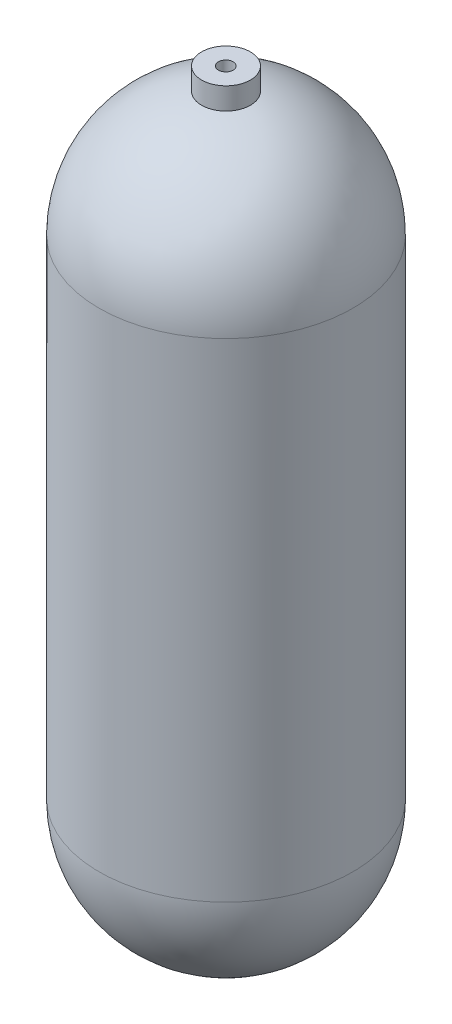
ISO-10303-21;
HEADER;
FILE_DESCRIPTION(('STEP AP214'),'2;1');
FILE_NAME('part.step','',(''),(''),'','','');
FILE_SCHEMA(('AUTOMOTIVE_DESIGN { 1 0 10303 214 1 1 1 1 }'));
ENDSEC;
DATA;
#1=APPLICATION_CONTEXT('core data for automotive mechanical design processes');
#2=APPLICATION_PROTOCOL_DEFINITION('international standard','automotive_design',2000,#1);
#3=PRODUCT_CONTEXT('',#1,'mechanical');
#4=PRODUCT('Part','Part','',(#3));
#5=PRODUCT_RELATED_PRODUCT_CATEGORY('part','',(#4));
#6=PRODUCT_DEFINITION_FORMATION('','',#4);
#7=PRODUCT_DEFINITION_CONTEXT('part definition',#1,'design');
#8=PRODUCT_DEFINITION('design','',#6,#7);
#9=PRODUCT_DEFINITION_SHAPE('','',#8);
#10=(LENGTH_UNIT() NAMED_UNIT(*) SI_UNIT(.MILLI.,.METRE.));
#11=(NAMED_UNIT(*) PLANE_ANGLE_UNIT() SI_UNIT($,.RADIAN.));
#12=(NAMED_UNIT(*) SI_UNIT($,.STERADIAN.) SOLID_ANGLE_UNIT());
#13=UNCERTAINTY_MEASURE_WITH_UNIT(LENGTH_MEASURE(1.E-05),#10,'distance_accuracy_value','');
#14=(GEOMETRIC_REPRESENTATION_CONTEXT(3) GLOBAL_UNCERTAINTY_ASSIGNED_CONTEXT((#13)) GLOBAL_UNIT_ASSIGNED_CONTEXT((#10,
#11,#12)) REPRESENTATION_CONTEXT('',''));
#15=CARTESIAN_POINT('',(0.,0.,0.));
#16=DIRECTION('',(0.,0.,1.));
#17=DIRECTION('',(1.,0.,0.));
#18=AXIS2_PLACEMENT_3D('',#15,#16,#17);
#19=CARTESIAN_POINT('',(0.,400.05,0.));
#20=DIRECTION('',(0.,-1.,0.));
#21=DIRECTION('',(1.,0.,0.));
#22=AXIS2_PLACEMENT_3D('',#19,#20,#21);
#23=SPHERICAL_SURFACE('',#22,79.375);
#24=CARTESIAN_POINT('',(-3.42182891379754,479.283643926154,-3.27282478421702));
#25=CARTESIAN_POINT('',(-3.32724378608084,479.283819493455,-3.36746714349013));
#26=CARTESIAN_POINT('',(-3.22867831230609,479.283993000192,-3.45810923366383));
#27=CARTESIAN_POINT('',(-3.02423425314201,479.284334759627,-3.63080333851585));
#28=CARTESIAN_POINT('',(-2.91835375041532,479.284503010928,-3.71285308677507));
#29=CARTESIAN_POINT('',(-2.6999640744647,479.284833149662,-3.86781322020325));
#30=CARTESIAN_POINT('',(-2.58744907387211,479.284995031285,-3.9407153894491));
#31=CARTESIAN_POINT('',(-2.3566326618785,479.28531118177,-4.07680321265141));
#32=CARTESIAN_POINT('',(-2.23832914921104,479.285465447827,-4.13998530314597));
#33=CARTESIAN_POINT('',(-1.99691881390394,479.285765077557,-4.25610131347749));
#34=CARTESIAN_POINT('',(-1.87381613455248,479.285910448644,-4.3090438479448));
#35=CARTESIAN_POINT('',(-1.62354230722062,479.286191449035,-4.40438854499081));
#36=CARTESIAN_POINT('',(-1.49636967597975,479.286327074728,-4.44678681426872));
#37=CARTESIAN_POINT('',(-1.23898354504171,479.286587479876,-4.52069306280468));
#38=CARTESIAN_POINT('',(-1.10877197182512,479.286712265977,-4.55220775150611));
#39=CARTESIAN_POINT('',(-0.846108785317474,479.286950243412,-4.60416882934251));
#40=CARTESIAN_POINT('',(-0.713656363045905,479.287063430449,-4.62461112928305));
#41=CARTESIAN_POINT('',(-0.447535502216847,479.287277324045,-4.65426034744694));
#42=CARTESIAN_POINT('',(-0.313867395010321,479.287378033902,-4.66347023991067));
#43=CARTESIAN_POINT('',(-0.0461809372042213,479.287566327682,-4.67060040456996));
#44=CARTESIAN_POINT('',(0.0878375244983195,479.287653906745,-4.66851650678845));
#45=CARTESIAN_POINT('',(0.355178188419601,479.287815244416,-4.65306675791729));
#46=CARTESIAN_POINT('',(0.488500605679306,479.287889007572,-4.63970462768494));
#47=CARTESIAN_POINT('',(0.753595086656516,479.288022250376,-4.60179142322715));
#48=CARTESIAN_POINT('',(0.885366559777697,479.288081724741,-4.57723621964258));
#49=CARTESIAN_POINT('',(1.14632161917054,479.288185910946,-4.51712133925673));
#50=CARTESIAN_POINT('',(1.27550619116798,479.288230628514,-4.48156594237651));
#51=CARTESIAN_POINT('',(1.53046679679788,479.288305030239,-4.3996874149897));
#52=CARTESIAN_POINT('',(1.6562415544062,479.28833470884,-4.35336031393506));
#53=CARTESIAN_POINT('',(1.90340160934877,479.288378784059,-4.25028549127625));
#54=CARTESIAN_POINT('',(2.02478851820304,479.288393186344,-4.19354164293117));
#55=CARTESIAN_POINT('',(2.26236886682056,479.288406644321,-4.07003488377526));
#56=CARTESIAN_POINT('',(2.3785603725966,479.288405694346,-4.00326828163797));
#57=CARTESIAN_POINT('',(2.71798349321446,479.288379746245,-3.78864660030895));
#58=CARTESIAN_POINT('',(2.93233192414992,479.288331697435,-3.62635750671579));
#59=CARTESIAN_POINT('',(3.33061873083215,479.288175403232,-3.26817992355853));
#60=CARTESIAN_POINT('',(3.51455716139319,479.288067157947,-3.07229149455881));
#61=CARTESIAN_POINT('',(3.84696905487324,479.28779355619,-2.65239213694546));
#62=CARTESIAN_POINT('',(3.99544250231223,479.287628199693,-2.42838119605677));
#63=CARTESIAN_POINT('',(4.25266528105569,479.287245064216,-1.95861801637802));
#64=CARTESIAN_POINT('',(4.36141457032074,479.287027285181,-1.71286575457981));
#65=CARTESIAN_POINT('',(4.53611370310213,479.286545487143,-1.2065902561513));
#66=CARTESIAN_POINT('',(4.60206353433991,479.286281468127,-0.946067015283424));
#67=CARTESIAN_POINT('',(4.68928839156489,479.285714682821,-0.417646822687992));
#68=CARTESIAN_POINT('',(4.71056343542461,479.285411916548,-0.149749873910391));
#69=CARTESIAN_POINT('',(4.70783571086039,479.284776230514,0.385813755024581));
#70=CARTESIAN_POINT('',(4.68383289579793,479.284443310723,0.653480434944479));
#71=CARTESIAN_POINT('',(4.59123051019416,479.283756766824,1.18098491118413));
#72=CARTESIAN_POINT('',(4.52263093361381,479.283403142712,1.44082270644374));
#73=CARTESIAN_POINT('',(4.34278236071065,479.282685228336,1.94529357918808));
#74=CARTESIAN_POINT('',(4.23153333284552,479.282320938064,2.18992664542767));
#75=CARTESIAN_POINT('',(3.96954388417127,479.281592031846,2.65704342402197));
#76=CARTESIAN_POINT('',(3.81880346503615,479.281227415901,2.87952713731557));
#77=CARTESIAN_POINT('',(3.48211025243716,479.280508209452,3.29602963847848));
#78=CARTESIAN_POINT('',(3.29615744739245,479.280153618951,3.49004841698606));
#79=CARTESIAN_POINT('',(2.89431812922667,479.279464529217,3.84411333339851));
#80=CARTESIAN_POINT('',(2.678431614774,479.279130029984,4.00415946979213));
#81=CARTESIAN_POINT('',(2.22285332712751,479.278490619958,4.28573581768841));
#82=CARTESIAN_POINT('',(1.98316155931369,479.278185709158,4.40726603789565));
#83=CARTESIAN_POINT('',(1.48677685795107,479.277614132023,4.60836062811376));
#84=CARTESIAN_POINT('',(1.23008392668449,479.277347465684,4.68792500375805));
#85=CARTESIAN_POINT('',(0.70698402853909,479.276859949373,4.80282945535449));
#86=CARTESIAN_POINT('',(0.440577070265346,479.276639099361,4.8381695704813));
#87=CARTESIAN_POINT('',(-0.0943892897860293,479.276249485666,4.86362166572035));
#88=CARTESIAN_POINT('',(-0.362948692424168,479.276080722004,4.85373362775032));
#89=CARTESIAN_POINT('',(-0.894593808588021,479.275800071882,4.78901285540226));
#90=CARTESIAN_POINT('',(-1.15767952526183,479.275688185389,4.73418014687415));
#91=CARTESIAN_POINT('',(-1.67091726729561,479.275524472452,4.58111628173989));
#92=CARTESIAN_POINT('',(-1.92106930636321,479.275472645945,4.4828851711302));
#93=CARTESIAN_POINT('',(-2.40130745910758,479.275430500058,4.2458519261364));
#94=CARTESIAN_POINT('',(-2.63139359346798,479.275440180616,4.10704983357286));
#95=CARTESIAN_POINT('',(-3.06508559479799,479.275520866454,3.79266966964993));
#96=CARTESIAN_POINT('',(-3.26869141409355,479.275591871845,3.61709153208195));
#97=CARTESIAN_POINT('',(-3.54967925948017,479.275742654924,3.33018336939835));
#98=CARTESIAN_POINT('',(-3.63931316704184,479.275800337879,3.23056416914393));
#99=CARTESIAN_POINT('',(-3.8098663835227,479.27593006224,3.02414263907862));
#100=CARTESIAN_POINT('',(-3.89078889649241,479.27600209834,2.91734297388361));
#101=CARTESIAN_POINT('',(-4.04337149798114,479.276160053787,2.69727261899747));
#102=CARTESIAN_POINT('',(-4.11502813700409,479.276245978279,2.58399954188612));
#103=CARTESIAN_POINT('',(-4.24851988998129,479.276431047832,2.3518598226456));
#104=CARTESIAN_POINT('',(-4.31035861888711,479.276530188003,2.23299526029405));
#105=CARTESIAN_POINT('',(-4.42382625268296,479.276741049,1.99043331442153));
#106=CARTESIAN_POINT('',(-4.47545118344125,479.276852774696,1.86673407208414));
#107=CARTESIAN_POINT('',(-4.56807766263725,479.277087937657,1.61547194437062));
#108=CARTESIAN_POINT('',(-4.60908312494818,479.277211370584,1.48791050184849));
#109=CARTESIAN_POINT('',(-4.68021574853717,479.27746914736,1.22974447230472));
#110=CARTESIAN_POINT('',(-4.71033931667858,479.277603494796,1.0991388952538));
#111=CARTESIAN_POINT('',(-4.75946595567182,479.277882058667,0.835902738650053));
#112=CARTESIAN_POINT('',(-4.77847312715971,479.278026271441,0.703272924350096));
#113=CARTESIAN_POINT('',(-4.80525272892095,479.278323624378,0.436848301855512));
#114=CARTESIAN_POINT('',(-4.81302217900002,479.278476766897,0.303053194090505));
#115=CARTESIAN_POINT('',(-4.81726080781721,479.278790797548,0.0353335792356443));
#116=CARTESIAN_POINT('',(-4.81373415445964,479.2789516828,-0.0985908619051065));
#117=CARTESIAN_POINT('',(-4.79540906844292,479.279280209578,-0.365749620473259));
#118=CARTESIAN_POINT('',(-4.78060367158939,479.279447855217,-0.498983460287015));
#119=CARTESIAN_POINT('',(-4.73982572902038,479.279788553692,-0.76368068280294));
#120=CARTESIAN_POINT('',(-4.71385730097424,479.279961604512,-0.895144699910887));
#121=CARTESIAN_POINT('',(-4.65091179788235,479.280312090771,-1.15552839773121));
#122=CARTESIAN_POINT('',(-4.61392542138712,479.280489529798,-1.28444583014832));
#123=CARTESIAN_POINT('',(-4.52923141826894,479.280847321085,-1.53865644228725));
#124=CARTESIAN_POINT('',(-4.4815277163297,479.281027672257,-1.66395092982105));
#125=CARTESIAN_POINT('',(-4.37577622558949,479.281389910151,-1.90996580624032));
#126=CARTESIAN_POINT('',(-4.31773769150012,479.281571795362,-2.03069017128688));
#127=CARTESIAN_POINT('',(-4.19172346138077,479.28193590559,-2.2667855992791));
#128=CARTESIAN_POINT('',(-4.12375038326001,479.282118130506,-2.38215806201632));
#129=CARTESIAN_POINT('',(-3.96021646428246,479.28252697025,-2.63474709107922));
#130=CARTESIAN_POINT('',(-3.86199977661827,479.282753346653,-2.77025471270232));
#131=CARTESIAN_POINT('',(-3.65186767280709,479.283202195338,-3.03019615081741));
#132=CARTESIAN_POINT('',(-3.53995225665379,479.283424667619,-3.1546299673043));
#133=CARTESIAN_POINT('',(-3.42182891379754,479.283643926154,-3.27282478421702));
#134=B_SPLINE_CURVE_WITH_KNOTS('',3,(#24,#25,#26,#27,#28,#29,#30,#31,#32,#33,#34,#35,#36,#37,
#38,#39,#40,#41,#42,#43,#44,#45,#46,#47,#48,#49,#50,#51,#52,#53,#54,#55,#56,#57,#58,#59,#60,#61,
#62,#63,#64,#65,#66,#67,#68,#69,#70,#71,#72,#73,#74,#75,#76,#77,#78,#79,#80,#81,#82,#83,#84,#85,
#86,#87,#88,#89,#90,#91,#92,#93,#94,#95,#96,#97,#98,#99,#100,#101,#102,#103,#104,#105,#106,#107,
#108,#109,#110,#111,#112,#113,#114,#115,#116,#117,#118,#119,#120,#121,#122,#123,#124,#125,#126,
#127,#128,#129,#130,#131,#132,#133),.UNSPECIFIED.,.T.,.F.,(4,2,2,2,2,2,2,2,2,2,2,2,2,2,2,2,2,2,
2,2,2,2,2,2,2,2,2,2,2,2,2,2,2,2,2,2,2,2,2,2,2,2,2,2,2,2,2,2,2,2,2,2,2,2,4),(0.,
0.401266521234322,0.8026386201419,1.20436867065518,1.60624564957986,2.00778304088307,
2.40946847403872,2.81090583471243,3.21249135113641,3.61397050822762,4.01559791253047,
4.41709286572405,4.81873605884145,5.22022317797988,5.62185852419278,6.0233448317167,
6.42497936892184,7.22738730117165,8.02979378705878,8.8322006231859,9.63460830848484,
10.4370162239831,11.239423818471,12.0418322394803,12.8442407691474,13.6466498922543,
14.4490589813479,15.2514683343423,16.0538777230316,16.8562869303764,17.6586960300073,
18.4611044188493,19.2635131284953,20.0659213766368,20.8683287743359,21.6707353449165,
22.4731433600969,22.8747776811396,23.276263772727,23.6778989017161,24.079385804085,
24.4810286168597,24.882523190257,25.2841502138552,25.6856289909705,26.0872142189824,
26.4886512918378,26.8903364379005,27.2918735427002,27.6937505939879,28.0954807171208,
28.4968528887321,28.8981194825034,29.3992441728944,29.9003688635166),.UNSPECIFIED.);
#135=CARTESIAN_POINT('',(-3.42182891379754,479.283643926154,-3.27282478421702));
#136=VERTEX_POINT('',#135);
#137=EDGE_CURVE('E39',#136,#136,#134,.T.);
#138=ORIENTED_EDGE('',*,*,#137,.F.);
#139=EDGE_LOOP('',(#138));
#140=FACE_BOUND('',#139,.T.);
#141=CARTESIAN_POINT('',(0.,400.05,0.));
#142=DIRECTION('',(0.,-1.,0.));
#143=DIRECTION('',(0.,0.,-1.));
#144=AXIS2_PLACEMENT_3D('',#141,#142,#143);
#145=CIRCLE('',#144,79.375);
#146=CARTESIAN_POINT('',(0.,400.05,-79.375));
#147=VERTEX_POINT('',#146);
#148=EDGE_CURVE('E47',#147,#147,#145,.T.);
#149=ORIENTED_EDGE('',*,*,#148,.T.);
#150=EDGE_LOOP('',(#149));
#151=FACE_BOUND('',#150,.T.);
#152=ADVANCED_FACE('F35',(#140,#151),#23,.F.);
#153=CARTESIAN_POINT('',(0.,482.6,0.));
#154=DIRECTION('',(0.,-1.,0.));
#155=DIRECTION('',(0.,0.,-1.));
#156=AXIS2_PLACEMENT_3D('',#153,#154,#155);
#157=CYLINDRICAL_SURFACE('',#156,79.375);
#158=CARTESIAN_POINT('',(0.,82.55,0.));
#159=DIRECTION('',(0.,-1.,0.));
#160=DIRECTION('',(0.,0.,-1.));
#161=AXIS2_PLACEMENT_3D('',#158,#159,#160);
#162=CIRCLE('',#161,79.375);
#163=CARTESIAN_POINT('',(0.,82.55,-79.375));
#164=VERTEX_POINT('',#163);
#165=EDGE_CURVE('E53',#164,#164,#162,.T.);
#166=ORIENTED_EDGE('',*,*,#165,.T.);
#167=EDGE_LOOP('',(#166));
#168=FACE_BOUND('',#167,.T.);
#169=ORIENTED_EDGE('',*,*,#148,.F.);
#170=EDGE_LOOP('',(#169));
#171=FACE_BOUND('',#170,.T.);
#172=ADVANCED_FACE('F80',(#168,#171),#157,.F.);
#173=CARTESIAN_POINT('',(0.,82.55,0.));
#174=DIRECTION('',(0.,-1.,0.));
#175=DIRECTION('',(1.,0.,0.));
#176=AXIS2_PLACEMENT_3D('',#173,#174,#175);
#177=SPHERICAL_SURFACE('',#176,79.375);
#178=ORIENTED_EDGE('',*,*,#165,.F.);
#179=EDGE_LOOP('',(#178));
#180=FACE_BOUND('',#179,.T.);
#181=ADVANCED_FACE('F84',(#180),#177,.F.);
#182=CARTESIAN_POINT('',(-0.0532386612324132,495.3,0.0937767604156647));
#183=DIRECTION('',(0.,1.,0.));
#184=DIRECTION('',(0.,0.,1.));
#185=AXIS2_PLACEMENT_3D('',#182,#183,#184);
#186=CYLINDRICAL_SURFACE('',#185,4.76249999999999);
#187=ORIENTED_EDGE('',*,*,#137,.T.);
#188=EDGE_LOOP('',(#187));
#189=FACE_BOUND('',#188,.T.);
#190=CARTESIAN_POINT('',(-0.0532386612324132,495.3,0.0937767604156647));
#191=DIRECTION('',(0.,1.,0.));
#192=DIRECTION('',(0.,0.,1.));
#193=AXIS2_PLACEMENT_3D('',#190,#191,#192);
#194=CIRCLE('',#193,4.7625);
#195=CARTESIAN_POINT('',(-0.0532386612324132,495.3,4.85627676041566));
#196=VERTEX_POINT('',#195);
#197=EDGE_CURVE('E69',#196,#196,#194,.T.);
#198=ORIENTED_EDGE('',*,*,#197,.T.);
#199=EDGE_LOOP('',(#198));
#200=FACE_BOUND('',#199,.T.);
#201=ADVANCED_FACE('F76',(#189,#200),#186,.F.);
#202=CARTESIAN_POINT('',(0.,400.05,0.));
#203=DIRECTION('',(0.,-1.,0.));
#204=DIRECTION('',(1.,0.,0.));
#205=AXIS2_PLACEMENT_3D('',#202,#203,#204);
#206=SPHERICAL_SURFACE('',#205,82.55);
#207=CARTESIAN_POINT('',(0.,481.059177720707,0.));
#208=DIRECTION('',(0.,-1.,0.));
#209=DIRECTION('',(0.,0.,-1.));
#210=AXIS2_PLACEMENT_3D('',#207,#208,#209);
#211=CIRCLE('',#210,15.875);
#212=CARTESIAN_POINT('',(0.,481.059177720681,15.875));
#213=VERTEX_POINT('',#212);
#214=EDGE_CURVE('E10',#213,#213,#211,.F.);
#215=ORIENTED_EDGE('',*,*,#214,.F.);
#216=EDGE_LOOP('',(#215));
#217=FACE_BOUND('',#216,.T.);
#218=CARTESIAN_POINT('',(0.,400.05,0.));
#219=DIRECTION('',(0.,-1.,0.));
#220=DIRECTION('',(0.,0.,-1.));
#221=AXIS2_PLACEMENT_3D('',#218,#219,#220);
#222=CIRCLE('',#221,82.55);
#223=CARTESIAN_POINT('',(0.,400.05,-82.55));
#224=VERTEX_POINT('',#223);
#225=EDGE_CURVE('E61',#224,#224,#222,.T.);
#226=ORIENTED_EDGE('',*,*,#225,.F.);
#227=EDGE_LOOP('',(#226));
#228=FACE_BOUND('',#227,.T.);
#229=ADVANCED_FACE('F37',(#217,#228),#206,.T.);
#230=CARTESIAN_POINT('',(0.,82.55,0.));
#231=DIRECTION('',(0.,-1.,0.));
#232=DIRECTION('',(-1.,0.,0.));
#233=AXIS2_PLACEMENT_3D('',#230,#231,#232);
#234=SPHERICAL_SURFACE('',#233,82.55);
#235=CARTESIAN_POINT('',(0.,82.55,0.));
#236=DIRECTION('',(0.,-1.,0.));
#237=DIRECTION('',(0.,0.,-1.));
#238=AXIS2_PLACEMENT_3D('',#235,#236,#237);
#239=CIRCLE('',#238,82.55);
#240=CARTESIAN_POINT('',(0.,82.55,-82.55));
#241=VERTEX_POINT('',#240);
#242=EDGE_CURVE('E58',#241,#241,#239,.T.);
#243=ORIENTED_EDGE('',*,*,#242,.T.);
#244=EDGE_LOOP('',(#243));
#245=FACE_BOUND('',#244,.T.);
#246=ADVANCED_FACE('F95',(#245),#234,.T.);
#247=CARTESIAN_POINT('',(0.,482.6,0.));
#248=DIRECTION('',(0.,-1.,0.));
#249=DIRECTION('',(0.,0.,-1.));
#250=AXIS2_PLACEMENT_3D('',#247,#248,#249);
#251=CYLINDRICAL_SURFACE('',#250,82.55);
#252=ORIENTED_EDGE('',*,*,#225,.T.);
#253=EDGE_LOOP('',(#252));
#254=FACE_BOUND('',#253,.T.);
#255=ORIENTED_EDGE('',*,*,#242,.F.);
#256=EDGE_LOOP('',(#255));
#257=FACE_BOUND('',#256,.T.);
#258=ADVANCED_FACE('F98',(#254,#257),#251,.T.);
#259=CARTESIAN_POINT('',(0.,-500000.,0.));
#260=DIRECTION('',(0.,1.,0.));
#261=DIRECTION('',(0.,0.,1.));
#262=AXIS2_PLACEMENT_3D('',#259,#260,#261);
#263=CYLINDRICAL_SURFACE('',#262,15.875);
#264=CARTESIAN_POINT('',(0.,495.3,0.));
#265=DIRECTION('',(0.,1.,0.));
#266=DIRECTION('',(0.,0.,1.));
#267=AXIS2_PLACEMENT_3D('',#264,#265,#266);
#268=CIRCLE('',#267,15.875);
#269=CARTESIAN_POINT('',(0.,495.300000000043,15.875));
#270=VERTEX_POINT('',#269);
#271=EDGE_CURVE('E65',#270,#270,#268,.T.);
#272=CARTESIAN_POINT('',(0.,481.059177720681,15.875));
#273=CARTESIAN_POINT('',(0.,481.207519619431,15.875));
#274=CARTESIAN_POINT('',(0.,481.355861518182,15.875));
#275=CARTESIAN_POINT('',(0.,481.652545315664,15.875));
#276=CARTESIAN_POINT('',(0.,481.800887214395,15.875));
#277=CARTESIAN_POINT('',(0.,482.097571011877,15.875));
#278=CARTESIAN_POINT('',(0.,482.245912910628,15.875));
#279=CARTESIAN_POINT('',(0.,482.54259670811,15.875));
#280=CARTESIAN_POINT('',(0.,482.690938606841,15.875));
#281=CARTESIAN_POINT('',(0.,482.987622404323,15.875));
#282=CARTESIAN_POINT('',(0.,483.135964303074,15.875));
#283=CARTESIAN_POINT('',(0.,483.432648100575,15.875));
#284=CARTESIAN_POINT('',(0.,483.580989999325,15.875));
#285=CARTESIAN_POINT('',(0.,483.877673796807,15.875));
#286=CARTESIAN_POINT('',(0.,484.026015695539,15.875));
#287=CARTESIAN_POINT('',(0.,484.322699493021,15.875));
#288=CARTESIAN_POINT('',(0.,484.471041391771,15.875));
#289=CARTESIAN_POINT('',(0.,484.767725189272,15.875));
#290=CARTESIAN_POINT('',(0.,484.916067088022,15.875));
#291=CARTESIAN_POINT('',(0.,485.212750885504,15.875));
#292=CARTESIAN_POINT('',(0.,485.361092784236,15.875));
#293=CARTESIAN_POINT('',(0.,485.657776581718,15.875));
#294=CARTESIAN_POINT('',(0.,485.806118480468,15.875));
#295=CARTESIAN_POINT('',(0.,486.102802277969,15.875));
#296=CARTESIAN_POINT('',(0.,486.25114417672,15.875));
#297=CARTESIAN_POINT('',(0.,486.547827974202,15.875));
#298=CARTESIAN_POINT('',(0.,486.696169872933,15.875));
#299=CARTESIAN_POINT('',(0.,486.992853670415,15.875));
#300=CARTESIAN_POINT('',(0.,487.141195569166,15.875));
#301=CARTESIAN_POINT('',(0.,487.437879366648,15.875));
#302=CARTESIAN_POINT('',(0.,487.586221265379,15.875));
#303=CARTESIAN_POINT('',(0.,487.882905062861,15.875));
#304=CARTESIAN_POINT('',(0.,488.031246961611,15.875));
#305=CARTESIAN_POINT('',(0.,488.327930759112,15.875));
#306=CARTESIAN_POINT('',(0.,488.476272657863,15.875));
#307=CARTESIAN_POINT('',(0.,488.772956455345,15.875));
#308=CARTESIAN_POINT('',(0.,488.921298354076,15.875));
#309=CARTESIAN_POINT('',(0.,489.217982151558,15.875));
#310=CARTESIAN_POINT('',(0.,489.366324050309,15.875));
#311=CARTESIAN_POINT('',(0.,489.663007847791,15.875));
#312=CARTESIAN_POINT('',(0.,489.811349746522,15.875));
#313=CARTESIAN_POINT('',(0.,490.108033544004,15.875));
#314=CARTESIAN_POINT('',(0.,490.256375442755,15.875));
#315=CARTESIAN_POINT('',(0.,490.553059240256,15.875));
#316=CARTESIAN_POINT('',(0.,490.701401139006,15.875));
#317=CARTESIAN_POINT('',(0.,490.998084936488,15.875));
#318=CARTESIAN_POINT('',(0.,491.14642683522,15.875));
#319=CARTESIAN_POINT('',(0.,491.443110632702,15.875));
#320=CARTESIAN_POINT('',(0.,491.591452531452,15.875));
#321=CARTESIAN_POINT('',(0.,491.888136328953,15.875));
#322=CARTESIAN_POINT('',(0.,492.036478227703,15.875));
#323=CARTESIAN_POINT('',(0.,492.333162025185,15.875));
#324=CARTESIAN_POINT('',(0.,492.481503923917,15.875));
#325=CARTESIAN_POINT('',(0.,492.778187721399,15.875));
#326=CARTESIAN_POINT('',(0.,492.926529620149,15.875));
#327=CARTESIAN_POINT('',(0.,493.22321341765,15.875));
#328=CARTESIAN_POINT('',(0.,493.371555316401,15.875));
#329=CARTESIAN_POINT('',(0.,493.668239113883,15.875));
#330=CARTESIAN_POINT('',(0.,493.816581012614,15.875));
#331=CARTESIAN_POINT('',(0.,494.113264810096,15.875));
#332=CARTESIAN_POINT('',(0.,494.261606708847,15.875));
#333=CARTESIAN_POINT('',(0.,494.558290506329,15.875));
#334=CARTESIAN_POINT('',(0.,494.70663240506,15.875));
#335=CARTESIAN_POINT('',(0.,495.003316202542,15.875));
#336=CARTESIAN_POINT('',(0.,495.151658101292,15.875));
#337=CARTESIAN_POINT('',(0.,495.300000000043,15.875));
#338=B_SPLINE_CURVE_WITH_KNOTS('',3,(#272,#273,#274,#275,#276,#277,#278,#279,#280,#281,#282,
#283,#284,#285,#286,#287,#288,#289,#290,#291,#292,#293,#294,#295,#296,#297,#298,#299,#300,#301,
#302,#303,#304,#305,#306,#307,#308,#309,#310,#311,#312,#313,#314,#315,#316,#317,#318,#319,#320,
#321,#322,#323,#324,#325,#326,#327,#328,#329,#330,#331,#332,#333,#334,#335,#336,#337),
.UNSPECIFIED.,.F.,.F.,(4,2,2,2,2,2,2,2,2,2,2,2,2,2,2,2,2,2,2,2,2,2,2,2,2,2,2,2,2,2,2,2,4),(0.,
0.445025696251378,0.890051392445912,1.33507708869729,1.78010278489182,2.2251284811432,
2.67015417739458,3.11517987358911,3.56020556984049,4.00523126609187,4.4502569622864,
4.89528265853778,5.34030835478916,5.78533405098369,6.23035974723507,6.6753854434296,
7.12041113968098,7.56543683593236,8.01046253212689,8.45548822837827,8.90051392457281,
9.34553962082418,9.79056531707556,10.2355910132701,10.6806167095215,11.1256424057729,
11.5706681019674,12.0156937982188,12.4607194944701,12.9057451906647,13.3507708869161,
13.7957965831106,14.240822279362),.UNSPECIFIED.);
#339=EDGE_CURVE('BSEAM102',#213,#270,#338,.T.);
#340=ORIENTED_EDGE('',*,*,#214,.T.);
#341=ORIENTED_EDGE('',*,*,#271,.F.);
#342=ORIENTED_EDGE('',*,*,#339,.T.);
#343=ORIENTED_EDGE('',*,*,#339,.F.);
#344=EDGE_LOOP('',(#340,#342,#341,#343));
#345=FACE_BOUND('',#344,.T.);
#346=ADVANCED_FACE('F102',(#345),#263,.T.);
#347=CARTESIAN_POINT('',(0.,495.3,0.));
#348=DIRECTION('',(0.,1.,0.));
#349=DIRECTION('',(0.,0.,1.));
#350=AXIS2_PLACEMENT_3D('',#347,#348,#349);
#351=PLANE('',#350);
#352=ORIENTED_EDGE('',*,*,#197,.F.);
#353=EDGE_LOOP('',(#352));
#354=FACE_BOUND('',#353,.T.);
#355=ORIENTED_EDGE('',*,*,#271,.T.);
#356=EDGE_LOOP('',(#355));
#357=FACE_BOUND('',#356,.T.);
#358=ADVANCED_FACE('F106',(#354,#357),#351,.T.);
#359=CLOSED_SHELL('',(#152,#172,#181,#201,#229,#246,#258,#346,#358));
#360=MANIFOLD_SOLID_BREP('B2',#359);
#361=ADVANCED_BREP_SHAPE_REPRESENTATION('',(#18,#360),#14);
#362=SHAPE_DEFINITION_REPRESENTATION(#9,#361);
ENDSEC;
END-ISO-10303-21;
